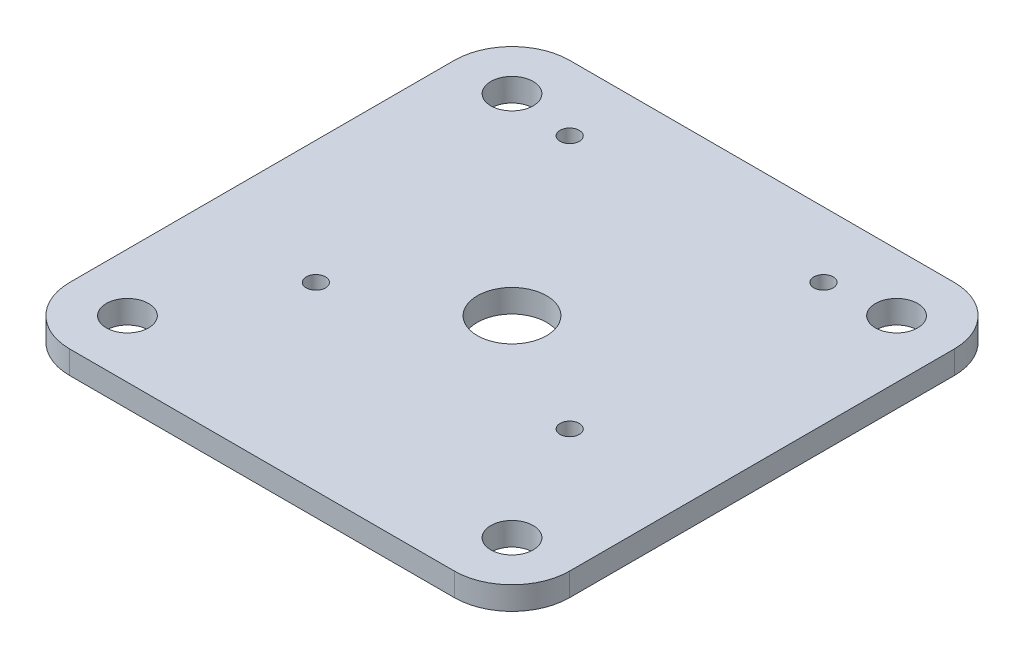
ISO-10303-21;
HEADER;
FILE_DESCRIPTION(('STEP AP214'),'2;1');
FILE_NAME('part.step','',(''),(''),'','','');
FILE_SCHEMA(('AUTOMOTIVE_DESIGN { 1 0 10303 214 1 1 1 1 }'));
ENDSEC;
DATA;
#1=APPLICATION_CONTEXT('core data for automotive mechanical design processes');
#2=APPLICATION_PROTOCOL_DEFINITION('international standard','automotive_design',2000,#1);
#3=PRODUCT_CONTEXT('',#1,'mechanical');
#4=PRODUCT('Part','Part','',(#3));
#5=PRODUCT_RELATED_PRODUCT_CATEGORY('part','',(#4));
#6=PRODUCT_DEFINITION_FORMATION('','',#4);
#7=PRODUCT_DEFINITION_CONTEXT('part definition',#1,'design');
#8=PRODUCT_DEFINITION('design','',#6,#7);
#9=PRODUCT_DEFINITION_SHAPE('','',#8);
#10=(LENGTH_UNIT() NAMED_UNIT(*) SI_UNIT(.MILLI.,.METRE.));
#11=(NAMED_UNIT(*) PLANE_ANGLE_UNIT() SI_UNIT($,.RADIAN.));
#12=(NAMED_UNIT(*) SI_UNIT($,.STERADIAN.) SOLID_ANGLE_UNIT());
#13=UNCERTAINTY_MEASURE_WITH_UNIT(LENGTH_MEASURE(1.E-05),#10,'distance_accuracy_value','');
#14=(GEOMETRIC_REPRESENTATION_CONTEXT(3) GLOBAL_UNCERTAINTY_ASSIGNED_CONTEXT((#13)) GLOBAL_UNIT_ASSIGNED_CONTEXT((#10,
#11,#12)) REPRESENTATION_CONTEXT('',''));
#15=CARTESIAN_POINT('',(0.,0.,0.));
#16=DIRECTION('',(0.,0.,1.));
#17=DIRECTION('',(1.,0.,0.));
#18=AXIS2_PLACEMENT_3D('',#15,#16,#17);
#19=CARTESIAN_POINT('',(-50.,6.,50.));
#20=DIRECTION('',(0.,-1.,0.));
#21=DIRECTION('',(0.,0.,-1.));
#22=AXIS2_PLACEMENT_3D('',#19,#20,#21);
#23=PLANE('',#22);
#24=CARTESIAN_POINT('',(33.,6.,18.));
#25=DIRECTION('',(0.,1.,0.));
#26=DIRECTION('',(0.,0.,1.));
#27=AXIS2_PLACEMENT_3D('',#24,#25,#26);
#28=CIRCLE('',#27,2.5);
#29=CARTESIAN_POINT('',(33.,6.,20.5));
#30=VERTEX_POINT('',#29);
#31=EDGE_CURVE('E266',#30,#30,#28,.T.);
#32=ORIENTED_EDGE('',*,*,#31,.F.);
#33=EDGE_LOOP('',(#32));
#34=FACE_BOUND('',#33,.T.);
#35=CARTESIAN_POINT('',(-33.,6.,-48.));
#36=DIRECTION('',(0.,1.,0.));
#37=DIRECTION('',(0.,0.,1.));
#38=AXIS2_PLACEMENT_3D('',#35,#36,#37);
#39=CIRCLE('',#38,2.5);
#40=CARTESIAN_POINT('',(-33.,6.,-45.5));
#41=VERTEX_POINT('',#40);
#42=EDGE_CURVE('E257',#41,#41,#39,.T.);
#43=ORIENTED_EDGE('',*,*,#42,.F.);
#44=EDGE_LOOP('',(#43));
#45=FACE_BOUND('',#44,.T.);
#46=CARTESIAN_POINT('',(-33.,6.,18.));
#47=DIRECTION('',(0.,1.,0.));
#48=DIRECTION('',(0.,0.,1.));
#49=AXIS2_PLACEMENT_3D('',#46,#47,#48);
#50=CIRCLE('',#49,2.5);
#51=CARTESIAN_POINT('',(-33.,6.,20.5));
#52=VERTEX_POINT('',#51);
#53=EDGE_CURVE('E273',#52,#52,#50,.T.);
#54=ORIENTED_EDGE('',*,*,#53,.F.);
#55=EDGE_LOOP('',(#54));
#56=FACE_BOUND('',#55,.T.);
#57=CARTESIAN_POINT('',(33.,6.,-48.));
#58=DIRECTION('',(0.,1.,0.));
#59=DIRECTION('',(0.,0.,1.));
#60=AXIS2_PLACEMENT_3D('',#57,#58,#59);
#61=CIRCLE('',#60,2.5);
#62=CARTESIAN_POINT('',(33.,6.,-45.5));
#63=VERTEX_POINT('',#62);
#64=EDGE_CURVE('E242',#63,#63,#61,.T.);
#65=ORIENTED_EDGE('',*,*,#64,.F.);
#66=EDGE_LOOP('',(#65));
#67=FACE_BOUND('',#66,.T.);
#68=CARTESIAN_POINT('',(-50.,6.,50.));
#69=DIRECTION('',(0.,-1.,0.));
#70=DIRECTION('',(0.,0.,-1.));
#71=AXIS2_PLACEMENT_3D('',#68,#69,#70);
#72=CIRCLE('',#71,5.5);
#73=CARTESIAN_POINT('',(-50.,6.,44.5));
#74=VERTEX_POINT('',#73);
#75=EDGE_CURVE('E213',#74,#74,#72,.T.);
#76=ORIENTED_EDGE('',*,*,#75,.T.);
#77=EDGE_LOOP('',(#76));
#78=FACE_BOUND('',#77,.T.);
#79=CARTESIAN_POINT('',(50.,6.,50.));
#80=DIRECTION('',(0.,-1.,0.));
#81=DIRECTION('',(0.,0.,-1.));
#82=AXIS2_PLACEMENT_3D('',#79,#80,#81);
#83=CIRCLE('',#82,5.49999999999999);
#84=CARTESIAN_POINT('',(50.,6.,44.5));
#85=VERTEX_POINT('',#84);
#86=EDGE_CURVE('E220',#85,#85,#83,.T.);
#87=ORIENTED_EDGE('',*,*,#86,.T.);
#88=EDGE_LOOP('',(#87));
#89=FACE_BOUND('',#88,.T.);
#90=CARTESIAN_POINT('',(50.,6.,-50.));
#91=DIRECTION('',(0.,-1.,0.));
#92=DIRECTION('',(0.,0.,-1.));
#93=AXIS2_PLACEMENT_3D('',#90,#91,#92);
#94=CIRCLE('',#93,5.49999999999999);
#95=CARTESIAN_POINT('',(50.,6.,-55.5));
#96=VERTEX_POINT('',#95);
#97=EDGE_CURVE('E224',#96,#96,#94,.T.);
#98=ORIENTED_EDGE('',*,*,#97,.T.);
#99=EDGE_LOOP('',(#98));
#100=FACE_BOUND('',#99,.T.);
#101=CARTESIAN_POINT('',(-50.,6.,-50.));
#102=DIRECTION('',(0.,-1.,0.));
#103=DIRECTION('',(0.,0.,-1.));
#104=AXIS2_PLACEMENT_3D('',#101,#102,#103);
#105=CIRCLE('',#104,5.5);
#106=CARTESIAN_POINT('',(-50.,6.,-55.5));
#107=VERTEX_POINT('',#106);
#108=EDGE_CURVE('E228',#107,#107,#105,.T.);
#109=ORIENTED_EDGE('',*,*,#108,.T.);
#110=EDGE_LOOP('',(#109));
#111=FACE_BOUND('',#110,.T.);
#112=CARTESIAN_POINT('',(-50.,6.,50.));
#113=DIRECTION('',(0.,1.,0.));
#114=DIRECTION('',(0.,0.,-1.));
#115=AXIS2_PLACEMENT_3D('',#112,#113,#114);
#116=CIRCLE('',#115,15.);
#117=CARTESIAN_POINT('',(-65.,6.,50.));
#118=VERTEX_POINT('',#117);
#119=CARTESIAN_POINT('',(-50.,6.,65.));
#120=VERTEX_POINT('',#119);
#121=EDGE_CURVE('E164',#118,#120,#116,.T.);
#122=ORIENTED_EDGE('',*,*,#121,.T.);
#123=DIRECTION('',(1.,0.,0.));
#124=VECTOR('',#123,1.);
#125=CARTESIAN_POINT('',(-50.,6.,65.));
#126=LINE('',#125,#124);
#127=CARTESIAN_POINT('',(50.,6.,65.));
#128=VERTEX_POINT('',#127);
#129=EDGE_CURVE('E100',#120,#128,#126,.T.);
#130=ORIENTED_EDGE('',*,*,#129,.T.);
#131=CARTESIAN_POINT('',(50.,6.,50.));
#132=DIRECTION('',(0.,1.,0.));
#133=DIRECTION('',(0.,0.,1.));
#134=AXIS2_PLACEMENT_3D('',#131,#132,#133);
#135=CIRCLE('',#134,15.);
#136=CARTESIAN_POINT('',(65.,6.,50.));
#137=VERTEX_POINT('',#136);
#138=EDGE_CURVE('E185',#128,#137,#135,.T.);
#139=ORIENTED_EDGE('',*,*,#138,.T.);
#140=DIRECTION('',(0.,0.,-1.));
#141=VECTOR('',#140,1.);
#142=CARTESIAN_POINT('',(65.,6.,50.));
#143=LINE('',#142,#141);
#144=CARTESIAN_POINT('',(65.,6.,-50.));
#145=VERTEX_POINT('',#144);
#146=EDGE_CURVE('E199',#137,#145,#143,.T.);
#147=ORIENTED_EDGE('',*,*,#146,.T.);
#148=CARTESIAN_POINT('',(50.,6.,-50.));
#149=DIRECTION('',(0.,1.,0.));
#150=DIRECTION('',(0.,0.,1.));
#151=AXIS2_PLACEMENT_3D('',#148,#149,#150);
#152=CIRCLE('',#151,15.);
#153=CARTESIAN_POINT('',(50.,6.,-65.));
#154=VERTEX_POINT('',#153);
#155=EDGE_CURVE('E119',#145,#154,#152,.T.);
#156=ORIENTED_EDGE('',*,*,#155,.T.);
#157=DIRECTION('',(-1.,0.,0.));
#158=VECTOR('',#157,1.);
#159=CARTESIAN_POINT('',(-50.,6.,-65.));
#160=LINE('',#159,#158);
#161=CARTESIAN_POINT('',(-50.,6.,-65.));
#162=VERTEX_POINT('',#161);
#163=EDGE_CURVE('E113',#154,#162,#160,.T.);
#164=ORIENTED_EDGE('',*,*,#163,.T.);
#165=CARTESIAN_POINT('',(-50.,6.,-50.));
#166=DIRECTION('',(0.,1.,0.));
#167=DIRECTION('',(0.,0.,-1.));
#168=AXIS2_PLACEMENT_3D('',#165,#166,#167);
#169=CIRCLE('',#168,15.);
#170=CARTESIAN_POINT('',(-65.,6.,-50.));
#171=VERTEX_POINT('',#170);
#172=EDGE_CURVE('E117',#162,#171,#169,.T.);
#173=ORIENTED_EDGE('',*,*,#172,.T.);
#174=DIRECTION('',(0.,0.,1.));
#175=VECTOR('',#174,1.);
#176=CARTESIAN_POINT('',(-65.,6.,50.));
#177=LINE('',#176,#175);
#178=EDGE_CURVE('E57',#171,#118,#177,.T.);
#179=ORIENTED_EDGE('',*,*,#178,.T.);
#180=EDGE_LOOP('',(#122,#130,#139,#147,#156,#164,#173,#179));
#181=FACE_BOUND('',#180,.T.);
#182=CARTESIAN_POINT('',(0.,6.,0.));
#183=DIRECTION('',(0.,1.,0.));
#184=DIRECTION('',(0.,0.,1.));
#185=AXIS2_PLACEMENT_3D('',#182,#183,#184);
#186=CIRCLE('',#185,9.);
#187=CARTESIAN_POINT('',(0.,6.,8.99999999999999));
#188=VERTEX_POINT('',#187);
#189=EDGE_CURVE('E146',#188,#188,#186,.T.);
#190=ORIENTED_EDGE('',*,*,#189,.F.);
#191=EDGE_LOOP('',(#190));
#192=FACE_BOUND('',#191,.T.);
#193=ADVANCED_FACE('F39',(#34,#45,#56,#67,#78,#89,#100,#111,#181,#192),#23,.F.);
#194=CARTESIAN_POINT('',(-50.,0.,50.));
#195=DIRECTION('',(0.,-1.,0.));
#196=DIRECTION('',(0.,0.,-1.));
#197=AXIS2_PLACEMENT_3D('',#194,#195,#196);
#198=PLANE('',#197);
#199=CARTESIAN_POINT('',(33.,0.,18.));
#200=DIRECTION('',(0.,-1.,0.));
#201=DIRECTION('',(0.,0.,-1.));
#202=AXIS2_PLACEMENT_3D('',#199,#200,#201);
#203=CIRCLE('',#202,2.5);
#204=CARTESIAN_POINT('',(33.,0.,15.5));
#205=VERTEX_POINT('',#204);
#206=EDGE_CURVE('E253',#205,#205,#203,.F.);
#207=ORIENTED_EDGE('',*,*,#206,.T.);
#208=EDGE_LOOP('',(#207));
#209=FACE_BOUND('',#208,.T.);
#210=CARTESIAN_POINT('',(-33.,0.,-48.));
#211=DIRECTION('',(0.,-1.,0.));
#212=DIRECTION('',(0.,0.,-1.));
#213=AXIS2_PLACEMENT_3D('',#210,#211,#212);
#214=CIRCLE('',#213,2.5);
#215=CARTESIAN_POINT('',(-33.,0.,-50.5));
#216=VERTEX_POINT('',#215);
#217=EDGE_CURVE('E261',#216,#216,#214,.F.);
#218=ORIENTED_EDGE('',*,*,#217,.T.);
#219=EDGE_LOOP('',(#218));
#220=FACE_BOUND('',#219,.T.);
#221=CARTESIAN_POINT('',(-33.,0.,18.));
#222=DIRECTION('',(0.,-1.,0.));
#223=DIRECTION('',(0.,0.,-1.));
#224=AXIS2_PLACEMENT_3D('',#221,#222,#223);
#225=CIRCLE('',#224,2.5);
#226=CARTESIAN_POINT('',(-33.,0.,15.5));
#227=VERTEX_POINT('',#226);
#228=EDGE_CURVE('E262',#227,#227,#225,.F.);
#229=ORIENTED_EDGE('',*,*,#228,.T.);
#230=EDGE_LOOP('',(#229));
#231=FACE_BOUND('',#230,.T.);
#232=CARTESIAN_POINT('',(33.,0.,-48.));
#233=DIRECTION('',(0.,-1.,0.));
#234=DIRECTION('',(0.,0.,-1.));
#235=AXIS2_PLACEMENT_3D('',#232,#233,#234);
#236=CIRCLE('',#235,2.5);
#237=CARTESIAN_POINT('',(33.,0.,-50.5));
#238=VERTEX_POINT('',#237);
#239=EDGE_CURVE('E249',#238,#238,#236,.F.);
#240=ORIENTED_EDGE('',*,*,#239,.T.);
#241=EDGE_LOOP('',(#240));
#242=FACE_BOUND('',#241,.T.);
#243=CARTESIAN_POINT('',(-50.,0.,50.));
#244=DIRECTION('',(0.,1.,0.));
#245=DIRECTION('',(0.,0.,1.));
#246=AXIS2_PLACEMENT_3D('',#243,#244,#245);
#247=CIRCLE('',#246,5.5);
#248=CARTESIAN_POINT('',(-50.,0.,55.5));
#249=VERTEX_POINT('',#248);
#250=EDGE_CURVE('E237',#249,#249,#247,.T.);
#251=ORIENTED_EDGE('',*,*,#250,.T.);
#252=EDGE_LOOP('',(#251));
#253=FACE_BOUND('',#252,.T.);
#254=CARTESIAN_POINT('',(50.,0.,50.));
#255=DIRECTION('',(0.,1.,0.));
#256=DIRECTION('',(0.,0.,1.));
#257=AXIS2_PLACEMENT_3D('',#254,#255,#256);
#258=CIRCLE('',#257,5.49999999999999);
#259=CARTESIAN_POINT('',(50.,0.,55.5));
#260=VERTEX_POINT('',#259);
#261=EDGE_CURVE('E241',#260,#260,#258,.T.);
#262=ORIENTED_EDGE('',*,*,#261,.T.);
#263=EDGE_LOOP('',(#262));
#264=FACE_BOUND('',#263,.T.);
#265=CARTESIAN_POINT('',(50.,0.,-50.));
#266=DIRECTION('',(0.,1.,0.));
#267=DIRECTION('',(0.,0.,1.));
#268=AXIS2_PLACEMENT_3D('',#265,#266,#267);
#269=CIRCLE('',#268,5.49999999999999);
#270=CARTESIAN_POINT('',(50.,0.,-44.5));
#271=VERTEX_POINT('',#270);
#272=EDGE_CURVE('E236',#271,#271,#269,.T.);
#273=ORIENTED_EDGE('',*,*,#272,.T.);
#274=EDGE_LOOP('',(#273));
#275=FACE_BOUND('',#274,.T.);
#276=CARTESIAN_POINT('',(-50.,0.,-50.));
#277=DIRECTION('',(0.,1.,0.));
#278=DIRECTION('',(0.,0.,1.));
#279=AXIS2_PLACEMENT_3D('',#276,#277,#278);
#280=CIRCLE('',#279,5.5);
#281=CARTESIAN_POINT('',(-50.,0.,-44.5));
#282=VERTEX_POINT('',#281);
#283=EDGE_CURVE('E232',#282,#282,#280,.T.);
#284=ORIENTED_EDGE('',*,*,#283,.T.);
#285=EDGE_LOOP('',(#284));
#286=FACE_BOUND('',#285,.T.);
#287=CARTESIAN_POINT('',(-50.,0.,50.));
#288=DIRECTION('',(0.,1.,0.));
#289=DIRECTION('',(0.,0.,-1.));
#290=AXIS2_PLACEMENT_3D('',#287,#288,#289);
#291=CIRCLE('',#290,15.);
#292=CARTESIAN_POINT('',(-65.,0.,50.));
#293=VERTEX_POINT('',#292);
#294=CARTESIAN_POINT('',(-50.,0.,65.));
#295=VERTEX_POINT('',#294);
#296=EDGE_CURVE('E141',#293,#295,#291,.T.);
#297=ORIENTED_EDGE('',*,*,#296,.F.);
#298=DIRECTION('',(0.,0.,1.));
#299=VECTOR('',#298,1.);
#300=CARTESIAN_POINT('',(-65.,0.,50.));
#301=LINE('',#300,#299);
#302=CARTESIAN_POINT('',(-65.,0.,-50.));
#303=VERTEX_POINT('',#302);
#304=EDGE_CURVE('E92',#303,#293,#301,.T.);
#305=ORIENTED_EDGE('',*,*,#304,.F.);
#306=CARTESIAN_POINT('',(-50.,0.,-50.));
#307=DIRECTION('',(0.,1.,0.));
#308=DIRECTION('',(0.,0.,-1.));
#309=AXIS2_PLACEMENT_3D('',#306,#307,#308);
#310=CIRCLE('',#309,15.);
#311=CARTESIAN_POINT('',(-50.,0.,-65.));
#312=VERTEX_POINT('',#311);
#313=EDGE_CURVE('E86',#312,#303,#310,.T.);
#314=ORIENTED_EDGE('',*,*,#313,.F.);
#315=DIRECTION('',(-1.,0.,0.));
#316=VECTOR('',#315,1.);
#317=CARTESIAN_POINT('',(-50.,0.,-65.));
#318=LINE('',#317,#316);
#319=CARTESIAN_POINT('',(50.,0.,-65.));
#320=VERTEX_POINT('',#319);
#321=EDGE_CURVE('E128',#320,#312,#318,.T.);
#322=ORIENTED_EDGE('',*,*,#321,.F.);
#323=CARTESIAN_POINT('',(50.,0.,-50.));
#324=DIRECTION('',(0.,1.,0.));
#325=DIRECTION('',(0.,0.,1.));
#326=AXIS2_PLACEMENT_3D('',#323,#324,#325);
#327=CIRCLE('',#326,15.);
#328=CARTESIAN_POINT('',(65.,0.,-50.));
#329=VERTEX_POINT('',#328);
#330=EDGE_CURVE('E155',#329,#320,#327,.T.);
#331=ORIENTED_EDGE('',*,*,#330,.F.);
#332=DIRECTION('',(0.,0.,-1.));
#333=VECTOR('',#332,1.);
#334=CARTESIAN_POINT('',(65.,0.,50.));
#335=LINE('',#334,#333);
#336=CARTESIAN_POINT('',(65.,0.,50.));
#337=VERTEX_POINT('',#336);
#338=EDGE_CURVE('E152',#337,#329,#335,.T.);
#339=ORIENTED_EDGE('',*,*,#338,.F.);
#340=CARTESIAN_POINT('',(50.,0.,50.));
#341=DIRECTION('',(0.,1.,0.));
#342=DIRECTION('',(0.,0.,1.));
#343=AXIS2_PLACEMENT_3D('',#340,#341,#342);
#344=CIRCLE('',#343,15.);
#345=CARTESIAN_POINT('',(50.,0.,65.));
#346=VERTEX_POINT('',#345);
#347=EDGE_CURVE('E149',#346,#337,#344,.T.);
#348=ORIENTED_EDGE('',*,*,#347,.F.);
#349=DIRECTION('',(1.,0.,0.));
#350=VECTOR('',#349,1.);
#351=CARTESIAN_POINT('',(-50.,0.,65.));
#352=LINE('',#351,#350);
#353=EDGE_CURVE('E145',#295,#346,#352,.T.);
#354=ORIENTED_EDGE('',*,*,#353,.F.);
#355=EDGE_LOOP('',(#297,#305,#314,#322,#331,#339,#348,#354));
#356=FACE_BOUND('',#355,.T.);
#357=CARTESIAN_POINT('',(0.,0.,0.));
#358=DIRECTION('',(0.,1.,0.));
#359=DIRECTION('',(0.,0.,1.));
#360=AXIS2_PLACEMENT_3D('',#357,#358,#359);
#361=CIRCLE('',#360,9.);
#362=CARTESIAN_POINT('',(0.,0.,8.99999999999999));
#363=VERTEX_POINT('',#362);
#364=EDGE_CURVE('E209',#363,#363,#361,.T.);
#365=ORIENTED_EDGE('',*,*,#364,.T.);
#366=EDGE_LOOP('',(#365));
#367=FACE_BOUND('',#366,.T.);
#368=ADVANCED_FACE('F189',(#209,#220,#231,#242,#253,#264,#275,#286,#356,#367),#198,.T.);
#369=CARTESIAN_POINT('',(-50.,6.,50.));
#370=DIRECTION('',(0.,-1.,0.));
#371=DIRECTION('',(0.,0.,-1.));
#372=AXIS2_PLACEMENT_3D('',#369,#370,#371);
#373=CYLINDRICAL_SURFACE('',#372,15.);
#374=ORIENTED_EDGE('',*,*,#296,.T.);
#375=DIRECTION('',(0.,-1.,0.));
#376=VECTOR('',#375,1.);
#377=CARTESIAN_POINT('',(-50.,6.,65.));
#378=LINE('',#377,#376);
#379=EDGE_CURVE('E11',#120,#295,#378,.T.);
#380=ORIENTED_EDGE('',*,*,#379,.F.);
#381=ORIENTED_EDGE('',*,*,#121,.F.);
#382=DIRECTION('',(0.,-1.,0.));
#383=VECTOR('',#382,1.);
#384=CARTESIAN_POINT('',(-65.,6.,50.));
#385=LINE('',#384,#383);
#386=EDGE_CURVE('E137',#118,#293,#385,.T.);
#387=ORIENTED_EDGE('',*,*,#386,.T.);
#388=EDGE_LOOP('',(#374,#380,#381,#387));
#389=FACE_BOUND('',#388,.T.);
#390=ADVANCED_FACE('F41',(#389),#373,.T.);
#391=CARTESIAN_POINT('',(-50.,6.,65.));
#392=DIRECTION('',(0.,0.,-1.));
#393=DIRECTION('',(-1.,0.,0.));
#394=AXIS2_PLACEMENT_3D('',#391,#392,#393);
#395=PLANE('',#394);
#396=ORIENTED_EDGE('',*,*,#353,.T.);
#397=DIRECTION('',(0.,-1.,0.));
#398=VECTOR('',#397,1.);
#399=CARTESIAN_POINT('',(50.,6.,65.));
#400=LINE('',#399,#398);
#401=EDGE_CURVE('E49',#128,#346,#400,.T.);
#402=ORIENTED_EDGE('',*,*,#401,.F.);
#403=ORIENTED_EDGE('',*,*,#129,.F.);
#404=ORIENTED_EDGE('',*,*,#379,.T.);
#405=EDGE_LOOP('',(#396,#402,#403,#404));
#406=FACE_BOUND('',#405,.T.);
#407=ADVANCED_FACE('F340',(#406),#395,.F.);
#408=CARTESIAN_POINT('',(50.,6.,50.));
#409=DIRECTION('',(0.,-1.,0.));
#410=DIRECTION('',(0.,0.,-1.));
#411=AXIS2_PLACEMENT_3D('',#408,#409,#410);
#412=CYLINDRICAL_SURFACE('',#411,15.);
#413=ORIENTED_EDGE('',*,*,#347,.T.);
#414=DIRECTION('',(0.,-1.,0.));
#415=VECTOR('',#414,1.);
#416=CARTESIAN_POINT('',(65.,6.,50.));
#417=LINE('',#416,#415);
#418=EDGE_CURVE('E175',#137,#337,#417,.T.);
#419=ORIENTED_EDGE('',*,*,#418,.F.);
#420=ORIENTED_EDGE('',*,*,#138,.F.);
#421=ORIENTED_EDGE('',*,*,#401,.T.);
#422=EDGE_LOOP('',(#413,#419,#420,#421));
#423=FACE_BOUND('',#422,.T.);
#424=ADVANCED_FACE('F183',(#423),#412,.T.);
#425=CARTESIAN_POINT('',(65.,6.,50.));
#426=DIRECTION('',(-1.,0.,0.));
#427=DIRECTION('',(0.,0.,1.));
#428=AXIS2_PLACEMENT_3D('',#425,#426,#427);
#429=PLANE('',#428);
#430=ORIENTED_EDGE('',*,*,#338,.T.);
#431=DIRECTION('',(0.,-1.,0.));
#432=VECTOR('',#431,1.);
#433=CARTESIAN_POINT('',(65.,6.,-50.));
#434=LINE('',#433,#432);
#435=EDGE_CURVE('E171',#145,#329,#434,.T.);
#436=ORIENTED_EDGE('',*,*,#435,.F.);
#437=ORIENTED_EDGE('',*,*,#146,.F.);
#438=ORIENTED_EDGE('',*,*,#418,.T.);
#439=EDGE_LOOP('',(#430,#436,#437,#438));
#440=FACE_BOUND('',#439,.T.);
#441=ADVANCED_FACE('F194',(#440),#429,.F.);
#442=CARTESIAN_POINT('',(50.,6.,-50.));
#443=DIRECTION('',(0.,-1.,0.));
#444=DIRECTION('',(0.,0.,-1.));
#445=AXIS2_PLACEMENT_3D('',#442,#443,#444);
#446=CYLINDRICAL_SURFACE('',#445,15.);
#447=ORIENTED_EDGE('',*,*,#330,.T.);
#448=DIRECTION('',(0.,-1.,0.));
#449=VECTOR('',#448,1.);
#450=CARTESIAN_POINT('',(50.,6.,-65.));
#451=LINE('',#450,#449);
#452=EDGE_CURVE('E130',#154,#320,#451,.T.);
#453=ORIENTED_EDGE('',*,*,#452,.F.);
#454=ORIENTED_EDGE('',*,*,#155,.F.);
#455=ORIENTED_EDGE('',*,*,#435,.T.);
#456=EDGE_LOOP('',(#447,#453,#454,#455));
#457=FACE_BOUND('',#456,.T.);
#458=ADVANCED_FACE('F197',(#457),#446,.T.);
#459=CARTESIAN_POINT('',(-50.,6.,-65.));
#460=DIRECTION('',(0.,0.,1.));
#461=DIRECTION('',(1.,0.,0.));
#462=AXIS2_PLACEMENT_3D('',#459,#460,#461);
#463=PLANE('',#462);
#464=ORIENTED_EDGE('',*,*,#321,.T.);
#465=DIRECTION('',(0.,-1.,0.));
#466=VECTOR('',#465,1.);
#467=CARTESIAN_POINT('',(-50.,6.,-65.));
#468=LINE('',#467,#466);
#469=EDGE_CURVE('E125',#162,#312,#468,.T.);
#470=ORIENTED_EDGE('',*,*,#469,.F.);
#471=ORIENTED_EDGE('',*,*,#163,.F.);
#472=ORIENTED_EDGE('',*,*,#452,.T.);
#473=EDGE_LOOP('',(#464,#470,#471,#472));
#474=FACE_BOUND('',#473,.T.);
#475=ADVANCED_FACE('F126',(#474),#463,.F.);
#476=CARTESIAN_POINT('',(-50.,6.,-50.));
#477=DIRECTION('',(0.,-1.,0.));
#478=DIRECTION('',(0.,0.,-1.));
#479=AXIS2_PLACEMENT_3D('',#476,#477,#478);
#480=CYLINDRICAL_SURFACE('',#479,15.);
#481=ORIENTED_EDGE('',*,*,#313,.T.);
#482=DIRECTION('',(0.,-1.,0.));
#483=VECTOR('',#482,1.);
#484=CARTESIAN_POINT('',(-65.,6.,-50.));
#485=LINE('',#484,#483);
#486=EDGE_CURVE('E131',#171,#303,#485,.T.);
#487=ORIENTED_EDGE('',*,*,#486,.F.);
#488=ORIENTED_EDGE('',*,*,#172,.F.);
#489=ORIENTED_EDGE('',*,*,#469,.T.);
#490=EDGE_LOOP('',(#481,#487,#488,#489));
#491=FACE_BOUND('',#490,.T.);
#492=ADVANCED_FACE('F133',(#491),#480,.T.);
#493=CARTESIAN_POINT('',(-65.,6.,50.));
#494=DIRECTION('',(1.,0.,0.));
#495=DIRECTION('',(0.,0.,-1.));
#496=AXIS2_PLACEMENT_3D('',#493,#494,#495);
#497=PLANE('',#496);
#498=ORIENTED_EDGE('',*,*,#304,.T.);
#499=ORIENTED_EDGE('',*,*,#386,.F.);
#500=ORIENTED_EDGE('',*,*,#178,.F.);
#501=ORIENTED_EDGE('',*,*,#486,.T.);
#502=EDGE_LOOP('',(#498,#499,#500,#501));
#503=FACE_BOUND('',#502,.T.);
#504=ADVANCED_FACE('F318',(#503),#497,.F.);
#505=CARTESIAN_POINT('',(0.,6.,0.));
#506=DIRECTION('',(0.,-1.,0.));
#507=DIRECTION('',(0.,0.,-1.));
#508=AXIS2_PLACEMENT_3D('',#505,#506,#507);
#509=CYLINDRICAL_SURFACE('',#508,9.);
#510=ORIENTED_EDGE('',*,*,#189,.T.);
#511=EDGE_LOOP('',(#510));
#512=FACE_BOUND('',#511,.T.);
#513=ORIENTED_EDGE('',*,*,#364,.F.);
#514=EDGE_LOOP('',(#513));
#515=FACE_BOUND('',#514,.T.);
#516=ADVANCED_FACE('F308',(#512,#515),#509,.F.);
#517=CARTESIAN_POINT('',(-50.,0.,-50.));
#518=DIRECTION('',(0.,1.,0.));
#519=DIRECTION('',(0.,0.,1.));
#520=AXIS2_PLACEMENT_3D('',#517,#518,#519);
#521=CYLINDRICAL_SURFACE('',#520,5.5);
#522=ORIENTED_EDGE('',*,*,#283,.F.);
#523=EDGE_LOOP('',(#522));
#524=FACE_BOUND('',#523,.T.);
#525=ORIENTED_EDGE('',*,*,#108,.F.);
#526=EDGE_LOOP('',(#525));
#527=FACE_BOUND('',#526,.T.);
#528=ADVANCED_FACE('F305',(#524,#527),#521,.F.);
#529=CARTESIAN_POINT('',(50.,0.,-50.));
#530=DIRECTION('',(0.,1.,0.));
#531=DIRECTION('',(0.,0.,1.));
#532=AXIS2_PLACEMENT_3D('',#529,#530,#531);
#533=CYLINDRICAL_SURFACE('',#532,5.49999999999999);
#534=ORIENTED_EDGE('',*,*,#272,.F.);
#535=EDGE_LOOP('',(#534));
#536=FACE_BOUND('',#535,.T.);
#537=ORIENTED_EDGE('',*,*,#97,.F.);
#538=EDGE_LOOP('',(#537));
#539=FACE_BOUND('',#538,.T.);
#540=ADVANCED_FACE('F307',(#536,#539),#533,.F.);
#541=CARTESIAN_POINT('',(50.,0.,50.));
#542=DIRECTION('',(0.,1.,0.));
#543=DIRECTION('',(0.,0.,1.));
#544=AXIS2_PLACEMENT_3D('',#541,#542,#543);
#545=CYLINDRICAL_SURFACE('',#544,5.49999999999999);
#546=ORIENTED_EDGE('',*,*,#261,.F.);
#547=EDGE_LOOP('',(#546));
#548=FACE_BOUND('',#547,.T.);
#549=ORIENTED_EDGE('',*,*,#86,.F.);
#550=EDGE_LOOP('',(#549));
#551=FACE_BOUND('',#550,.T.);
#552=ADVANCED_FACE('F315',(#548,#551),#545,.F.);
#553=CARTESIAN_POINT('',(-50.,0.,50.));
#554=DIRECTION('',(0.,1.,0.));
#555=DIRECTION('',(0.,0.,1.));
#556=AXIS2_PLACEMENT_3D('',#553,#554,#555);
#557=CYLINDRICAL_SURFACE('',#556,5.5);
#558=ORIENTED_EDGE('',*,*,#250,.F.);
#559=EDGE_LOOP('',(#558));
#560=FACE_BOUND('',#559,.T.);
#561=ORIENTED_EDGE('',*,*,#75,.F.);
#562=EDGE_LOOP('',(#561));
#563=FACE_BOUND('',#562,.T.);
#564=ADVANCED_FACE('F323',(#560,#563),#557,.F.);
#565=CARTESIAN_POINT('',(33.,-0.00100000000000013,-48.));
#566=DIRECTION('',(0.,1.,0.));
#567=DIRECTION('',(0.,0.,1.));
#568=AXIS2_PLACEMENT_3D('',#565,#566,#567);
#569=CYLINDRICAL_SURFACE('',#568,2.5);
#570=ORIENTED_EDGE('',*,*,#239,.F.);
#571=EDGE_LOOP('',(#570));
#572=FACE_BOUND('',#571,.T.);
#573=ORIENTED_EDGE('',*,*,#64,.T.);
#574=EDGE_LOOP('',(#573));
#575=FACE_BOUND('',#574,.T.);
#576=ADVANCED_FACE('F287',(#572,#575),#569,.F.);
#577=CARTESIAN_POINT('',(-33.,-0.00100000000000013,18.));
#578=DIRECTION('',(0.,1.,0.));
#579=DIRECTION('',(0.,0.,1.));
#580=AXIS2_PLACEMENT_3D('',#577,#578,#579);
#581=CYLINDRICAL_SURFACE('',#580,2.5);
#582=ORIENTED_EDGE('',*,*,#228,.F.);
#583=EDGE_LOOP('',(#582));
#584=FACE_BOUND('',#583,.T.);
#585=ORIENTED_EDGE('',*,*,#53,.T.);
#586=EDGE_LOOP('',(#585));
#587=FACE_BOUND('',#586,.T.);
#588=ADVANCED_FACE('F283',(#584,#587),#581,.F.);
#589=CARTESIAN_POINT('',(-33.,-0.00100000000000013,-48.));
#590=DIRECTION('',(0.,1.,0.));
#591=DIRECTION('',(0.,0.,1.));
#592=AXIS2_PLACEMENT_3D('',#589,#590,#591);
#593=CYLINDRICAL_SURFACE('',#592,2.5);
#594=ORIENTED_EDGE('',*,*,#217,.F.);
#595=EDGE_LOOP('',(#594));
#596=FACE_BOUND('',#595,.T.);
#597=ORIENTED_EDGE('',*,*,#42,.T.);
#598=EDGE_LOOP('',(#597));
#599=FACE_BOUND('',#598,.T.);
#600=ADVANCED_FACE('F286',(#596,#599),#593,.F.);
#601=CARTESIAN_POINT('',(33.,-0.00100000000000013,18.));
#602=DIRECTION('',(0.,1.,0.));
#603=DIRECTION('',(0.,0.,1.));
#604=AXIS2_PLACEMENT_3D('',#601,#602,#603);
#605=CYLINDRICAL_SURFACE('',#604,2.5);
#606=ORIENTED_EDGE('',*,*,#206,.F.);
#607=EDGE_LOOP('',(#606));
#608=FACE_BOUND('',#607,.T.);
#609=ORIENTED_EDGE('',*,*,#31,.T.);
#610=EDGE_LOOP('',(#609));
#611=FACE_BOUND('',#610,.T.);
#612=ADVANCED_FACE('F448',(#608,#611),#605,.F.);
#613=CLOSED_SHELL('',(#193,#368,#390,#407,#424,#441,#458,#475,#492,#504,#516,#528,#540,#552,
#564,#576,#588,#600,#612));
#614=MANIFOLD_SOLID_BREP('B2',#613);
#615=ADVANCED_BREP_SHAPE_REPRESENTATION('',(#18,#614),#14);
#616=SHAPE_DEFINITION_REPRESENTATION(#9,#615);
ENDSEC;
END-ISO-10303-21;
